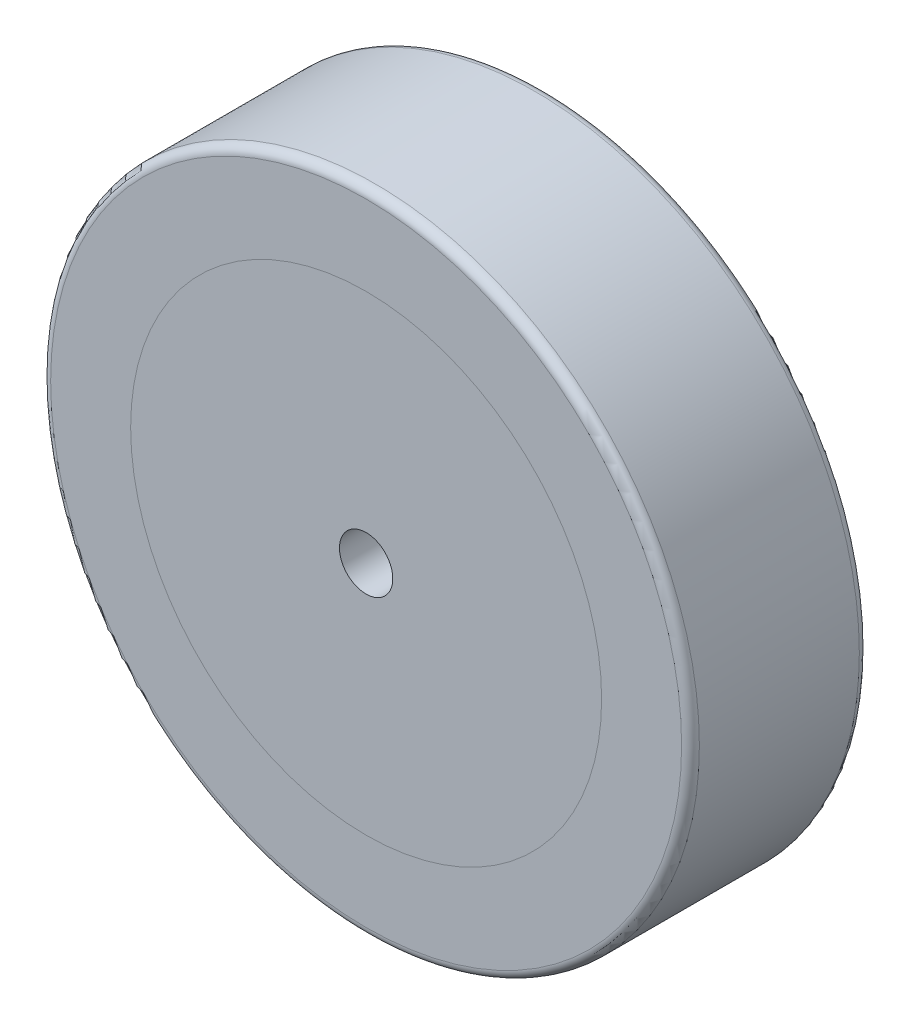
ISO-10303-21;
HEADER;
FILE_DESCRIPTION(('STEP AP214'),'2;1');
FILE_NAME('part.step','',(''),(''),'','','');
FILE_SCHEMA(('AUTOMOTIVE_DESIGN { 1 0 10303 214 1 1 1 1 }'));
ENDSEC;
DATA;
#1=APPLICATION_CONTEXT('core data for automotive mechanical design processes');
#2=APPLICATION_PROTOCOL_DEFINITION('international standard','automotive_design',2000,#1);
#3=PRODUCT_CONTEXT('',#1,'mechanical');
#4=PRODUCT('Part','Part','',(#3));
#5=PRODUCT_RELATED_PRODUCT_CATEGORY('part','',(#4));
#6=PRODUCT_DEFINITION_FORMATION('','',#4);
#7=PRODUCT_DEFINITION_CONTEXT('part definition',#1,'design');
#8=PRODUCT_DEFINITION('design','',#6,#7);
#9=PRODUCT_DEFINITION_SHAPE('','',#8);
#10=(LENGTH_UNIT() NAMED_UNIT(*) SI_UNIT(.MILLI.,.METRE.));
#11=(NAMED_UNIT(*) PLANE_ANGLE_UNIT() SI_UNIT($,.RADIAN.));
#12=(NAMED_UNIT(*) SI_UNIT($,.STERADIAN.) SOLID_ANGLE_UNIT());
#13=UNCERTAINTY_MEASURE_WITH_UNIT(LENGTH_MEASURE(1.E-05),#10,'distance_accuracy_value','');
#14=(GEOMETRIC_REPRESENTATION_CONTEXT(3) GLOBAL_UNCERTAINTY_ASSIGNED_CONTEXT((#13)) GLOBAL_UNIT_ASSIGNED_CONTEXT((#10,
#11,#12)) REPRESENTATION_CONTEXT('',''));
#15=CARTESIAN_POINT('',(0.,0.,0.));
#16=DIRECTION('',(0.,0.,1.));
#17=DIRECTION('',(1.,0.,0.));
#18=AXIS2_PLACEMENT_3D('',#15,#16,#17);
#19=CARTESIAN_POINT('',(0.,0.,0.));
#20=DIRECTION('',(0.,0.,1.));
#21=DIRECTION('',(1.,0.,0.));
#22=AXIS2_PLACEMENT_3D('',#19,#20,#21);
#23=CYLINDRICAL_SURFACE('',#22,26.5);
#24=CARTESIAN_POINT('',(0.,0.,0.));
#25=DIRECTION('',(0.,0.,1.));
#26=DIRECTION('',(1.,0.,0.));
#27=AXIS2_PLACEMENT_3D('',#24,#25,#26);
#28=CIRCLE('',#27,26.5);
#29=CARTESIAN_POINT('',(26.5,0.,0.));
#30=VERTEX_POINT('',#29);
#31=EDGE_CURVE('E11',#30,#30,#28,.T.);
#32=ORIENTED_EDGE('',*,*,#31,.T.);
#33=EDGE_LOOP('',(#32));
#34=FACE_BOUND('',#33,.T.);
#35=CARTESIAN_POINT('',(0.,0.,20.));
#36=DIRECTION('',(0.,0.,1.));
#37=DIRECTION('',(1.,0.,0.));
#38=AXIS2_PLACEMENT_3D('',#35,#36,#37);
#39=CIRCLE('',#38,26.5);
#40=CARTESIAN_POINT('',(26.5,0.,20.));
#41=VERTEX_POINT('',#40);
#42=EDGE_CURVE('E42',#41,#41,#39,.T.);
#43=ORIENTED_EDGE('',*,*,#42,.F.);
#44=EDGE_LOOP('',(#43));
#45=FACE_BOUND('',#44,.T.);
#46=ADVANCED_FACE('F39',(#34,#45),#23,.T.);
#47=CARTESIAN_POINT('',(0.,0.,0.));
#48=DIRECTION('',(0.,0.,1.));
#49=DIRECTION('',(1.,0.,0.));
#50=AXIS2_PLACEMENT_3D('',#47,#48,#49);
#51=PLANE('',#50);
#52=CARTESIAN_POINT('',(0.,0.,0.));
#53=DIRECTION('',(0.,0.,-1.));
#54=DIRECTION('',(-1.,0.,0.));
#55=AXIS2_PLACEMENT_3D('',#52,#53,#54);
#56=CIRCLE('',#55,3.);
#57=CARTESIAN_POINT('',(-3.,0.,0.));
#58=VERTEX_POINT('',#57);
#59=EDGE_CURVE('E53',#58,#58,#56,.T.);
#60=ORIENTED_EDGE('',*,*,#59,.F.);
#61=EDGE_LOOP('',(#60));
#62=FACE_BOUND('',#61,.T.);
#63=ORIENTED_EDGE('',*,*,#31,.F.);
#64=EDGE_LOOP('',(#63));
#65=FACE_BOUND('',#64,.T.);
#66=ADVANCED_FACE('F59',(#62,#65),#51,.F.);
#67=CARTESIAN_POINT('',(0.,0.,20.));
#68=DIRECTION('',(0.,0.,1.));
#69=DIRECTION('',(1.,0.,0.));
#70=AXIS2_PLACEMENT_3D('',#67,#68,#69);
#71=PLANE('',#70);
#72=CARTESIAN_POINT('',(0.,0.,20.));
#73=DIRECTION('',(0.,0.,-1.));
#74=DIRECTION('',(-1.,0.,0.));
#75=AXIS2_PLACEMENT_3D('',#72,#73,#74);
#76=CIRCLE('',#75,3.);
#77=CARTESIAN_POINT('',(-3.,0.,20.));
#78=VERTEX_POINT('',#77);
#79=EDGE_CURVE('E49',#78,#78,#76,.T.);
#80=ORIENTED_EDGE('',*,*,#79,.T.);
#81=EDGE_LOOP('',(#80));
#82=FACE_BOUND('',#81,.T.);
#83=ORIENTED_EDGE('',*,*,#42,.T.);
#84=EDGE_LOOP('',(#83));
#85=FACE_BOUND('',#84,.T.);
#86=ADVANCED_FACE('F62',(#82,#85),#71,.T.);
#87=CARTESIAN_POINT('',(0.,0.,0.));
#88=DIRECTION('',(0.,0.,-1.));
#89=DIRECTION('',(-1.,0.,0.));
#90=AXIS2_PLACEMENT_3D('',#87,#88,#89);
#91=CYLINDRICAL_SURFACE('',#90,3.);
#92=ORIENTED_EDGE('',*,*,#79,.F.);
#93=EDGE_LOOP('',(#92));
#94=FACE_BOUND('',#93,.T.);
#95=ORIENTED_EDGE('',*,*,#59,.T.);
#96=EDGE_LOOP('',(#95));
#97=FACE_BOUND('',#96,.T.);
#98=ADVANCED_FACE('F57',(#94,#97),#91,.F.);
#99=CLOSED_SHELL('',(#46,#66,#86,#98));
#100=MANIFOLD_SOLID_BREP('B2',#99);
#101=CARTESIAN_POINT('',(0.,0.,20.));
#102=DIRECTION('',(0.,0.,-1.));
#103=DIRECTION('',(-1.,0.,0.));
#104=AXIS2_PLACEMENT_3D('',#101,#102,#103);
#105=CYLINDRICAL_SURFACE('',#104,36.5);
#106=CARTESIAN_POINT('',(0.,0.,1.));
#107=DIRECTION('',(0.,0.,1.));
#108=DIRECTION('',(1.,0.,0.));
#109=AXIS2_PLACEMENT_3D('',#106,#107,#108);
#110=CIRCLE('',#109,36.5);
#111=CARTESIAN_POINT('',(36.5,0.,1.));
#112=VERTEX_POINT('',#111);
#113=EDGE_CURVE('E112',#112,#112,#110,.T.);
#114=ORIENTED_EDGE('',*,*,#113,.T.);
#115=EDGE_LOOP('',(#114));
#116=FACE_BOUND('',#115,.T.);
#117=CARTESIAN_POINT('',(0.,0.,19.));
#118=DIRECTION('',(0.,0.,1.));
#119=DIRECTION('',(1.,0.,0.));
#120=AXIS2_PLACEMENT_3D('',#117,#118,#119);
#121=CIRCLE('',#120,36.5);
#122=CARTESIAN_POINT('',(36.5,0.,19.));
#123=VERTEX_POINT('',#122);
#124=EDGE_CURVE('E116',#123,#123,#121,.F.);
#125=ORIENTED_EDGE('',*,*,#124,.T.);
#126=EDGE_LOOP('',(#125));
#127=FACE_BOUND('',#126,.T.);
#128=ADVANCED_FACE('F101',(#116,#127),#105,.T.);
#129=CARTESIAN_POINT('',(0.,0.,20.));
#130=DIRECTION('',(0.,0.,1.));
#131=DIRECTION('',(1.,0.,0.));
#132=AXIS2_PLACEMENT_3D('',#129,#130,#131);
#133=PLANE('',#132);
#134=CARTESIAN_POINT('',(0.,0.,20.));
#135=DIRECTION('',(0.,0.,1.));
#136=DIRECTION('',(1.,0.,0.));
#137=AXIS2_PLACEMENT_3D('',#134,#135,#136);
#138=CIRCLE('',#137,35.5);
#139=CARTESIAN_POINT('',(35.5,0.,20.));
#140=VERTEX_POINT('',#139);
#141=EDGE_CURVE('E38',#140,#140,#138,.T.);
#142=ORIENTED_EDGE('',*,*,#141,.T.);
#143=EDGE_LOOP('',(#142));
#144=FACE_BOUND('',#143,.T.);
#145=CARTESIAN_POINT('',(0.,0.,20.));
#146=DIRECTION('',(0.,0.,1.));
#147=DIRECTION('',(1.,0.,0.));
#148=AXIS2_PLACEMENT_3D('',#145,#146,#147);
#149=CIRCLE('',#148,26.5);
#150=CARTESIAN_POINT('',(26.5,0.,20.));
#151=VERTEX_POINT('',#150);
#152=EDGE_CURVE('E122',#151,#151,#149,.T.);
#153=ORIENTED_EDGE('',*,*,#152,.F.);
#154=EDGE_LOOP('',(#153));
#155=FACE_BOUND('',#154,.T.);
#156=ADVANCED_FACE('F137',(#144,#155),#133,.T.);
#157=CARTESIAN_POINT('',(0.,0.,0.));
#158=DIRECTION('',(0.,0.,1.));
#159=DIRECTION('',(1.,0.,0.));
#160=AXIS2_PLACEMENT_3D('',#157,#158,#159);
#161=PLANE('',#160);
#162=CARTESIAN_POINT('',(0.,0.,0.));
#163=DIRECTION('',(0.,0.,1.));
#164=DIRECTION('',(1.,0.,0.));
#165=AXIS2_PLACEMENT_3D('',#162,#163,#164);
#166=CIRCLE('',#165,35.5);
#167=CARTESIAN_POINT('',(35.5,0.,0.));
#168=VERTEX_POINT('',#167);
#169=EDGE_CURVE('E108',#168,#168,#166,.F.);
#170=ORIENTED_EDGE('',*,*,#169,.T.);
#171=EDGE_LOOP('',(#170));
#172=FACE_BOUND('',#171,.T.);
#173=CARTESIAN_POINT('',(0.,0.,0.));
#174=DIRECTION('',(0.,0.,1.));
#175=DIRECTION('',(1.,0.,0.));
#176=AXIS2_PLACEMENT_3D('',#173,#174,#175);
#177=CIRCLE('',#176,26.5);
#178=CARTESIAN_POINT('',(26.5,0.,0.));
#179=VERTEX_POINT('',#178);
#180=EDGE_CURVE('E121',#179,#179,#177,.T.);
#181=ORIENTED_EDGE('',*,*,#180,.T.);
#182=EDGE_LOOP('',(#181));
#183=FACE_BOUND('',#182,.T.);
#184=ADVANCED_FACE('F128',(#172,#183),#161,.F.);
#185=CARTESIAN_POINT('',(0.,0.,0.));
#186=DIRECTION('',(0.,0.,1.));
#187=DIRECTION('',(1.,0.,0.));
#188=AXIS2_PLACEMENT_3D('',#185,#186,#187);
#189=CYLINDRICAL_SURFACE('',#188,26.5);
#190=ORIENTED_EDGE('',*,*,#180,.F.);
#191=EDGE_LOOP('',(#190));
#192=FACE_BOUND('',#191,.T.);
#193=ORIENTED_EDGE('',*,*,#152,.T.);
#194=EDGE_LOOP('',(#193));
#195=FACE_BOUND('',#194,.T.);
#196=ADVANCED_FACE('F130',(#192,#195),#189,.F.);
#197=CARTESIAN_POINT('',(0.,0.,1.));
#198=DIRECTION('',(0.,0.,1.));
#199=DIRECTION('',(1.,0.,0.));
#200=AXIS2_PLACEMENT_3D('',#197,#198,#199);
#201=TOROIDAL_SURFACE('',#200,35.5,1.);
#202=ORIENTED_EDGE('',*,*,#169,.F.);
#203=EDGE_LOOP('',(#202));
#204=FACE_BOUND('',#203,.T.);
#205=ORIENTED_EDGE('',*,*,#113,.F.);
#206=EDGE_LOOP('',(#205));
#207=FACE_BOUND('',#206,.T.);
#208=ADVANCED_FACE('F133',(#204,#207),#201,.T.);
#209=CARTESIAN_POINT('',(0.,0.,19.));
#210=DIRECTION('',(0.,0.,1.));
#211=DIRECTION('',(1.,0.,0.));
#212=AXIS2_PLACEMENT_3D('',#209,#210,#211);
#213=TOROIDAL_SURFACE('',#212,35.5,1.);
#214=ORIENTED_EDGE('',*,*,#124,.F.);
#215=EDGE_LOOP('',(#214));
#216=FACE_BOUND('',#215,.T.);
#217=ORIENTED_EDGE('',*,*,#141,.F.);
#218=EDGE_LOOP('',(#217));
#219=FACE_BOUND('',#218,.T.);
#220=ADVANCED_FACE('F103',(#216,#219),#213,.T.);
#221=CLOSED_SHELL('',(#128,#156,#184,#196,#208,#220));
#222=MANIFOLD_SOLID_BREP('B6',#221);
#223=ADVANCED_BREP_SHAPE_REPRESENTATION('',(#18,#100,#222),#14);
#224=SHAPE_DEFINITION_REPRESENTATION(#9,#223);
ENDSEC;
END-ISO-10303-21;
